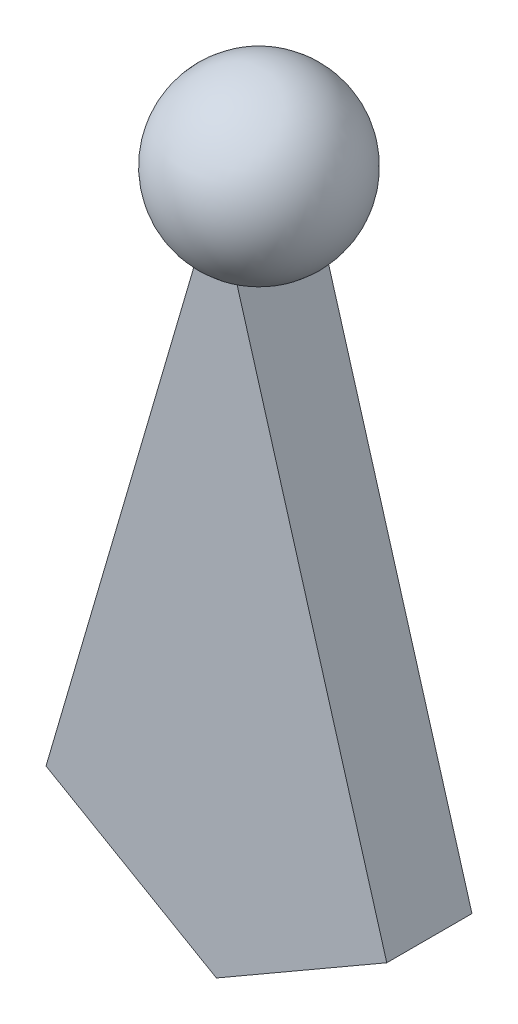
ISO-10303-21;
HEADER;
FILE_DESCRIPTION(('STEP AP214'),'2;1');
FILE_NAME('part.step','',(''),(''),'','','');
FILE_SCHEMA(('AUTOMOTIVE_DESIGN { 1 0 10303 214 1 1 1 1 }'));
ENDSEC;
DATA;
#1=APPLICATION_CONTEXT('core data for automotive mechanical design processes');
#2=APPLICATION_PROTOCOL_DEFINITION('international standard','automotive_design',2000,#1);
#3=PRODUCT_CONTEXT('',#1,'mechanical');
#4=PRODUCT('Part','Part','',(#3));
#5=PRODUCT_RELATED_PRODUCT_CATEGORY('part','',(#4));
#6=PRODUCT_DEFINITION_FORMATION('','',#4);
#7=PRODUCT_DEFINITION_CONTEXT('part definition',#1,'design');
#8=PRODUCT_DEFINITION('design','',#6,#7);
#9=PRODUCT_DEFINITION_SHAPE('','',#8);
#10=(LENGTH_UNIT() NAMED_UNIT(*) SI_UNIT(.MILLI.,.METRE.));
#11=(NAMED_UNIT(*) PLANE_ANGLE_UNIT() SI_UNIT($,.RADIAN.));
#12=(NAMED_UNIT(*) SI_UNIT($,.STERADIAN.) SOLID_ANGLE_UNIT());
#13=UNCERTAINTY_MEASURE_WITH_UNIT(LENGTH_MEASURE(1.E-05),#10,'distance_accuracy_value','');
#14=(GEOMETRIC_REPRESENTATION_CONTEXT(3) GLOBAL_UNCERTAINTY_ASSIGNED_CONTEXT((#13)) GLOBAL_UNIT_ASSIGNED_CONTEXT((#10,
#11,#12)) REPRESENTATION_CONTEXT('',''));
#15=CARTESIAN_POINT('',(0.,0.,0.));
#16=DIRECTION('',(0.,0.,1.));
#17=DIRECTION('',(1.,0.,0.));
#18=AXIS2_PLACEMENT_3D('',#15,#16,#17);
#19=CARTESIAN_POINT('',(0.,40.,0.));
#20=DIRECTION('',(0.,-1.,0.));
#21=DIRECTION('',(-1.,0.,0.));
#22=AXIS2_PLACEMENT_3D('',#19,#20,#21);
#23=SPHERICAL_SURFACE('',#22,5.);
#24=CARTESIAN_POINT('',(0.,40.,0.));
#25=DIRECTION('',(0.959869695869551,-0.280446370900561,0.));
#26=DIRECTION('',(0.280446370900561,0.959869695869551,0.));
#27=AXIS2_PLACEMENT_3D('',#24,#25,#26);
#28=CIRCLE('',#27,5.);
#29=CARTESIAN_POINT('',(-1.21436840799519,35.8436422952706,-2.5));
#30=VERTEX_POINT('',#29);
#31=CARTESIAN_POINT('',(-1.21436840799519,35.8436422952706,2.5));
#32=VERTEX_POINT('',#31);
#33=EDGE_CURVE('E50',#30,#32,#28,.F.);
#34=ORIENTED_EDGE('',*,*,#33,.T.);
#35=CARTESIAN_POINT('',(0.,40.,2.5));
#36=DIRECTION('',(0.,0.,-1.));
#37=DIRECTION('',(-1.,0.,0.));
#38=AXIS2_PLACEMENT_3D('',#35,#36,#37);
#39=CIRCLE('',#38,4.33012701892219);
#40=CARTESIAN_POINT('',(1.21436840799519,35.8436422952706,2.5));
#41=VERTEX_POINT('',#40);
#42=EDGE_CURVE('E11',#32,#41,#39,.F.);
#43=ORIENTED_EDGE('',*,*,#42,.T.);
#44=CARTESIAN_POINT('',(0.,40.,0.));
#45=DIRECTION('',(-0.959869695869551,-0.280446370900561,0.));
#46=DIRECTION('',(0.280446370900561,-0.959869695869551,0.));
#47=AXIS2_PLACEMENT_3D('',#44,#45,#46);
#48=CIRCLE('',#47,5.);
#49=CARTESIAN_POINT('',(1.21436840799519,35.8436422952706,-2.5));
#50=VERTEX_POINT('',#49);
#51=EDGE_CURVE('E40',#41,#50,#48,.F.);
#52=ORIENTED_EDGE('',*,*,#51,.T.);
#53=CARTESIAN_POINT('',(0.,40.,-2.5));
#54=DIRECTION('',(0.,0.,-1.));
#55=DIRECTION('',(-1.,0.,0.));
#56=AXIS2_PLACEMENT_3D('',#53,#54,#55);
#57=CIRCLE('',#56,4.33012701892219);
#58=EDGE_CURVE('E91',#30,#50,#57,.F.);
#59=ORIENTED_EDGE('',*,*,#58,.F.);
#60=EDGE_LOOP('',(#34,#43,#52,#59));
#61=FACE_BOUND('',#60,.T.);
#62=ADVANCED_FACE('F33',(#61),#23,.T.);
#63=CARTESIAN_POINT('',(10.,5.77350269189627,2.5));
#64=DIRECTION('',(-0.959869695869551,-0.280446370900561,0.));
#65=DIRECTION('',(0.280446370900561,-0.959869695869551,0.));
#66=AXIS2_PLACEMENT_3D('',#63,#64,#65);
#67=PLANE('',#66);
#68=ORIENTED_EDGE('',*,*,#51,.F.);
#69=DIRECTION('',(-0.280446370900561,0.959869695869551,0.));
#70=VECTOR('',#69,1.);
#71=CARTESIAN_POINT('',(10.,5.77350269189627,2.5));
#72=LINE('',#71,#70);
#73=CARTESIAN_POINT('',(10.,5.77350269189627,2.5));
#74=VERTEX_POINT('',#73);
#75=EDGE_CURVE('E82',#74,#41,#72,.T.);
#76=ORIENTED_EDGE('',*,*,#75,.F.);
#77=DIRECTION('',(0.,0.,-1.));
#78=VECTOR('',#77,1.);
#79=CARTESIAN_POINT('',(10.,5.77350269189627,2.5));
#80=LINE('',#79,#78);
#81=CARTESIAN_POINT('',(10.,5.77350269189627,-2.5));
#82=VERTEX_POINT('',#81);
#83=EDGE_CURVE('E99',#74,#82,#80,.T.);
#84=ORIENTED_EDGE('',*,*,#83,.T.);
#85=DIRECTION('',(-0.280446370900561,0.959869695869551,0.));
#86=VECTOR('',#85,1.);
#87=CARTESIAN_POINT('',(10.,5.77350269189627,-2.5));
#88=LINE('',#87,#86);
#89=EDGE_CURVE('E103',#82,#50,#88,.T.);
#90=ORIENTED_EDGE('',*,*,#89,.T.);
#91=EDGE_LOOP('',(#68,#76,#84,#90));
#92=FACE_BOUND('',#91,.T.);
#93=ADVANCED_FACE('F122',(#92),#67,.F.);
#94=CARTESIAN_POINT('',(0.,40.,2.5));
#95=DIRECTION('',(0.959869695869551,-0.280446370900561,0.));
#96=DIRECTION('',(0.280446370900561,0.959869695869551,0.));
#97=AXIS2_PLACEMENT_3D('',#94,#95,#96);
#98=PLANE('',#97);
#99=ORIENTED_EDGE('',*,*,#33,.F.);
#100=DIRECTION('',(-0.280446370900561,-0.959869695869551,0.));
#101=VECTOR('',#100,1.);
#102=CARTESIAN_POINT('',(0.,40.,-2.5));
#103=LINE('',#102,#101);
#104=CARTESIAN_POINT('',(-10.,5.77350269189627,-2.5));
#105=VERTEX_POINT('',#104);
#106=EDGE_CURVE('E88',#30,#105,#103,.T.);
#107=ORIENTED_EDGE('',*,*,#106,.T.);
#108=DIRECTION('',(0.,0.,-1.));
#109=VECTOR('',#108,1.);
#110=CARTESIAN_POINT('',(-10.,5.77350269189627,2.5));
#111=LINE('',#110,#109);
#112=CARTESIAN_POINT('',(-10.,5.77350269189627,2.5));
#113=VERTEX_POINT('',#112);
#114=EDGE_CURVE('E85',#113,#105,#111,.T.);
#115=ORIENTED_EDGE('',*,*,#114,.F.);
#116=DIRECTION('',(-0.280446370900561,-0.959869695869551,0.));
#117=VECTOR('',#116,1.);
#118=CARTESIAN_POINT('',(0.,40.,2.5));
#119=LINE('',#118,#117);
#120=EDGE_CURVE('E74',#32,#113,#119,.T.);
#121=ORIENTED_EDGE('',*,*,#120,.F.);
#122=EDGE_LOOP('',(#99,#107,#115,#121));
#123=FACE_BOUND('',#122,.T.);
#124=ADVANCED_FACE('F86',(#123),#98,.F.);
#125=CARTESIAN_POINT('',(-10.,5.77350269189627,2.5));
#126=DIRECTION('',(0.500000000000001,0.866025403784438,0.));
#127=DIRECTION('',(-0.866025403784438,0.500000000000001,0.));
#128=AXIS2_PLACEMENT_3D('',#125,#126,#127);
#129=PLANE('',#128);
#130=DIRECTION('',(0.866025403784438,-0.500000000000001,0.));
#131=VECTOR('',#130,1.);
#132=CARTESIAN_POINT('',(-10.,5.77350269189627,-2.5));
#133=LINE('',#132,#131);
#134=CARTESIAN_POINT('',(0.,0.,-2.5));
#135=VERTEX_POINT('',#134);
#136=EDGE_CURVE('E107',#105,#135,#133,.T.);
#137=ORIENTED_EDGE('',*,*,#136,.T.);
#138=DIRECTION('',(0.,0.,-1.));
#139=VECTOR('',#138,1.);
#140=CARTESIAN_POINT('',(0.,0.,2.5));
#141=LINE('',#140,#139);
#142=CARTESIAN_POINT('',(0.,0.,2.5));
#143=VERTEX_POINT('',#142);
#144=EDGE_CURVE('E92',#143,#135,#141,.T.);
#145=ORIENTED_EDGE('',*,*,#144,.F.);
#146=DIRECTION('',(0.866025403784438,-0.500000000000001,0.));
#147=VECTOR('',#146,1.);
#148=CARTESIAN_POINT('',(-10.,5.77350269189627,2.5));
#149=LINE('',#148,#147);
#150=EDGE_CURVE('E78',#113,#143,#149,.T.);
#151=ORIENTED_EDGE('',*,*,#150,.F.);
#152=ORIENTED_EDGE('',*,*,#114,.T.);
#153=EDGE_LOOP('',(#137,#145,#151,#152));
#154=FACE_BOUND('',#153,.T.);
#155=ADVANCED_FACE('F94',(#154),#129,.F.);
#156=CARTESIAN_POINT('',(0.,0.,2.5));
#157=DIRECTION('',(-0.500000000000001,0.866025403784438,0.));
#158=DIRECTION('',(-0.866025403784438,-0.500000000000001,0.));
#159=AXIS2_PLACEMENT_3D('',#156,#157,#158);
#160=PLANE('',#159);
#161=DIRECTION('',(0.866025403784438,0.500000000000001,0.));
#162=VECTOR('',#161,1.);
#163=CARTESIAN_POINT('',(0.,0.,-2.5));
#164=LINE('',#163,#162);
#165=EDGE_CURVE('E109',#135,#82,#164,.T.);
#166=ORIENTED_EDGE('',*,*,#165,.T.);
#167=ORIENTED_EDGE('',*,*,#83,.F.);
#168=DIRECTION('',(0.866025403784438,0.500000000000001,0.));
#169=VECTOR('',#168,1.);
#170=CARTESIAN_POINT('',(0.,0.,2.5));
#171=LINE('',#170,#169);
#172=EDGE_CURVE('E97',#143,#74,#171,.T.);
#173=ORIENTED_EDGE('',*,*,#172,.F.);
#174=ORIENTED_EDGE('',*,*,#144,.T.);
#175=EDGE_LOOP('',(#166,#167,#173,#174));
#176=FACE_BOUND('',#175,.T.);
#177=ADVANCED_FACE('F125',(#176),#160,.F.);
#178=CARTESIAN_POINT('',(10.,5.77350269189627,2.5));
#179=DIRECTION('',(0.,0.,-1.));
#180=DIRECTION('',(-1.,0.,0.));
#181=AXIS2_PLACEMENT_3D('',#178,#179,#180);
#182=PLANE('',#181);
#183=ORIENTED_EDGE('',*,*,#42,.F.);
#184=ORIENTED_EDGE('',*,*,#120,.T.);
#185=ORIENTED_EDGE('',*,*,#150,.T.);
#186=ORIENTED_EDGE('',*,*,#172,.T.);
#187=ORIENTED_EDGE('',*,*,#75,.T.);
#188=EDGE_LOOP('',(#183,#184,#185,#186,#187));
#189=FACE_BOUND('',#188,.T.);
#190=ADVANCED_FACE('F76',(#189),#182,.F.);
#191=CARTESIAN_POINT('',(10.,5.77350269189627,-2.5));
#192=DIRECTION('',(0.,0.,-1.));
#193=DIRECTION('',(-1.,0.,0.));
#194=AXIS2_PLACEMENT_3D('',#191,#192,#193);
#195=PLANE('',#194);
#196=ORIENTED_EDGE('',*,*,#106,.F.);
#197=ORIENTED_EDGE('',*,*,#58,.T.);
#198=ORIENTED_EDGE('',*,*,#89,.F.);
#199=ORIENTED_EDGE('',*,*,#165,.F.);
#200=ORIENTED_EDGE('',*,*,#136,.F.);
#201=EDGE_LOOP('',(#196,#197,#198,#199,#200));
#202=FACE_BOUND('',#201,.T.);
#203=ADVANCED_FACE('F120',(#202),#195,.T.);
#204=CLOSED_SHELL('',(#62,#93,#124,#155,#177,#190,#203));
#205=MANIFOLD_SOLID_BREP('B2',#204);
#206=ADVANCED_BREP_SHAPE_REPRESENTATION('',(#18,#205),#14);
#207=SHAPE_DEFINITION_REPRESENTATION(#9,#206);
ENDSEC;
END-ISO-10303-21;
